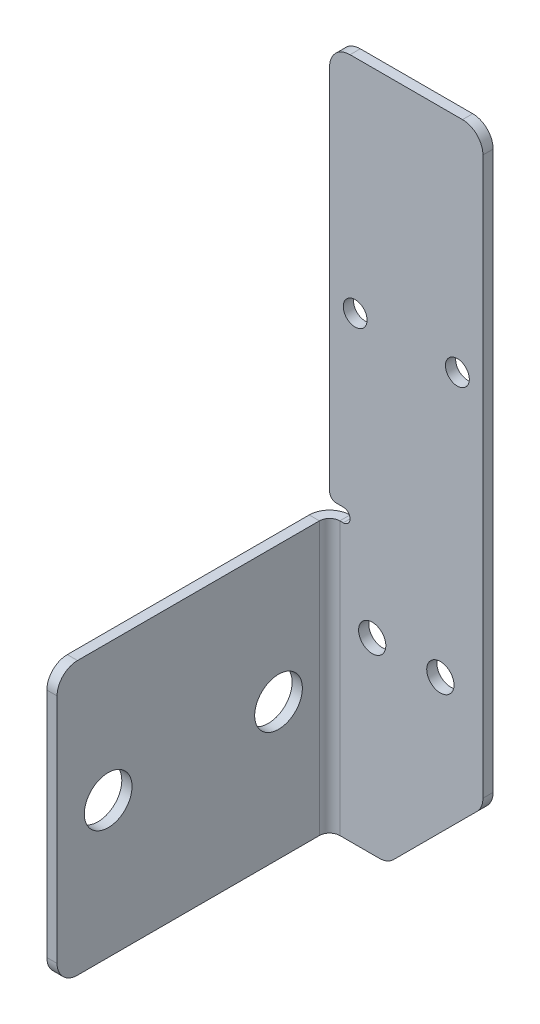
ISO-10303-21;
HEADER;
FILE_DESCRIPTION(('STEP AP214'),'2;1');
FILE_NAME('part.step','',(''),(''),'','','');
FILE_SCHEMA(('AUTOMOTIVE_DESIGN { 1 0 10303 214 1 1 1 1 }'));
ENDSEC;
DATA;
#1=APPLICATION_CONTEXT('core data for automotive mechanical design processes');
#2=APPLICATION_PROTOCOL_DEFINITION('international standard','automotive_design',2000,#1);
#3=PRODUCT_CONTEXT('',#1,'mechanical');
#4=PRODUCT('Part','Part','',(#3));
#5=PRODUCT_RELATED_PRODUCT_CATEGORY('part','',(#4));
#6=PRODUCT_DEFINITION_FORMATION('','',#4);
#7=PRODUCT_DEFINITION_CONTEXT('part definition',#1,'design');
#8=PRODUCT_DEFINITION('design','',#6,#7);
#9=PRODUCT_DEFINITION_SHAPE('','',#8);
#10=(LENGTH_UNIT() NAMED_UNIT(*) SI_UNIT(.MILLI.,.METRE.));
#11=(NAMED_UNIT(*) PLANE_ANGLE_UNIT() SI_UNIT($,.RADIAN.));
#12=(NAMED_UNIT(*) SI_UNIT($,.STERADIAN.) SOLID_ANGLE_UNIT());
#13=UNCERTAINTY_MEASURE_WITH_UNIT(LENGTH_MEASURE(1.E-05),#10,'distance_accuracy_value','');
#14=(GEOMETRIC_REPRESENTATION_CONTEXT(3) GLOBAL_UNCERTAINTY_ASSIGNED_CONTEXT((#13)) GLOBAL_UNIT_ASSIGNED_CONTEXT((#10,
#11,#12)) REPRESENTATION_CONTEXT('',''));
#15=CARTESIAN_POINT('',(0.,0.,0.));
#16=DIRECTION('',(0.,0.,1.));
#17=DIRECTION('',(1.,0.,0.));
#18=AXIS2_PLACEMENT_3D('',#15,#16,#17);
#19=CARTESIAN_POINT('',(10.,0.,1.5));
#20=DIRECTION('',(0.,1.,0.));
#21=DIRECTION('',(1.,0.,0.));
#22=AXIS2_PLACEMENT_3D('',#19,#20,#21);
#23=PLANE('',#22);
#24=DIRECTION('',(0.,0.,1.));
#25=VECTOR('',#24,1.);
#26=CARTESIAN_POINT('',(3.,0.,1.5));
#27=LINE('',#26,#25);
#28=CARTESIAN_POINT('',(3.,0.,0.));
#29=VERTEX_POINT('',#28);
#30=CARTESIAN_POINT('',(3.,0.,1.5));
#31=VERTEX_POINT('',#30);
#32=EDGE_CURVE('E11',#29,#31,#27,.T.);
#33=ORIENTED_EDGE('',*,*,#32,.F.);
#34=DIRECTION('',(-1.,0.,0.));
#35=VECTOR('',#34,1.);
#36=CARTESIAN_POINT('',(0.,0.,0.));
#37=LINE('',#36,#35);
#38=CARTESIAN_POINT('',(8.75735931288071,0.,0.));
#39=VERTEX_POINT('',#38);
#40=EDGE_CURVE('E127',#29,#39,#37,.F.);
#41=ORIENTED_EDGE('',*,*,#40,.T.);
#42=DIRECTION('',(0.,0.,1.));
#43=VECTOR('',#42,1.);
#44=CARTESIAN_POINT('',(8.75735931288071,0.,1.5));
#45=LINE('',#44,#43);
#46=CARTESIAN_POINT('',(8.75735931288071,0.,1.5));
#47=VERTEX_POINT('',#46);
#48=EDGE_CURVE('E49',#39,#47,#45,.T.);
#49=ORIENTED_EDGE('',*,*,#48,.T.);
#50=DIRECTION('',(1.,0.,0.));
#51=VECTOR('',#50,1.);
#52=CARTESIAN_POINT('',(10.,0.,1.5));
#53=LINE('',#52,#51);
#54=EDGE_CURVE('E129',#31,#47,#53,.T.);
#55=ORIENTED_EDGE('',*,*,#54,.F.);
#56=EDGE_LOOP('',(#33,#41,#49,#55));
#57=FACE_BOUND('',#56,.T.);
#58=ADVANCED_FACE('F39',(#57),#23,.F.);
#59=CARTESIAN_POINT('',(8.75735931288071,3.,1.5));
#60=DIRECTION('',(0.,0.,-1.));
#61=DIRECTION('',(-1.,0.,0.));
#62=AXIS2_PLACEMENT_3D('',#59,#60,#61);
#63=CYLINDRICAL_SURFACE('',#62,3.);
#64=ORIENTED_EDGE('',*,*,#48,.F.);
#65=CARTESIAN_POINT('',(8.75735931288071,3.,0.));
#66=DIRECTION('',(0.,0.,-1.));
#67=DIRECTION('',(-1.,0.,0.));
#68=AXIS2_PLACEMENT_3D('',#65,#66,#67);
#69=CIRCLE('',#68,3.);
#70=CARTESIAN_POINT('',(10.8786796564404,0.878679656440359,0.));
#71=VERTEX_POINT('',#70);
#72=EDGE_CURVE('E154',#39,#71,#69,.F.);
#73=ORIENTED_EDGE('',*,*,#72,.T.);
#74=DIRECTION('',(0.,0.,1.));
#75=VECTOR('',#74,1.);
#76=CARTESIAN_POINT('',(10.8786796564404,0.878679656440359,1.5));
#77=LINE('',#76,#75);
#78=CARTESIAN_POINT('',(10.8786796564404,0.878679656440359,1.5));
#79=VERTEX_POINT('',#78);
#80=EDGE_CURVE('E226',#71,#79,#77,.T.);
#81=ORIENTED_EDGE('',*,*,#80,.T.);
#82=CARTESIAN_POINT('',(8.75735931288071,3.,1.5));
#83=DIRECTION('',(0.,0.,-1.));
#84=DIRECTION('',(-1.,0.,0.));
#85=AXIS2_PLACEMENT_3D('',#82,#83,#84);
#86=CIRCLE('',#85,3.);
#87=EDGE_CURVE('E240',#47,#79,#86,.F.);
#88=ORIENTED_EDGE('',*,*,#87,.F.);
#89=EDGE_LOOP('',(#64,#73,#81,#88));
#90=FACE_BOUND('',#89,.T.);
#91=ADVANCED_FACE('F246',(#90),#63,.T.);
#92=CARTESIAN_POINT('',(24.,14.0000000000001,1.5));
#93=DIRECTION('',(-0.707106781186549,0.707106781186546,0.));
#94=DIRECTION('',(0.707106781186546,0.707106781186549,0.));
#95=AXIS2_PLACEMENT_3D('',#92,#93,#94);
#96=PLANE('',#95);
#97=ORIENTED_EDGE('',*,*,#80,.F.);
#98=DIRECTION('',(0.707106781186546,0.707106781186549,0.));
#99=VECTOR('',#98,1.);
#100=CARTESIAN_POINT('',(24.,14.0000000000001,0.));
#101=LINE('',#100,#99);
#102=CARTESIAN_POINT('',(23.1213203435597,13.1213203435597,0.));
#103=VERTEX_POINT('',#102);
#104=EDGE_CURVE('E342',#71,#103,#101,.T.);
#105=ORIENTED_EDGE('',*,*,#104,.T.);
#106=DIRECTION('',(0.,0.,1.));
#107=VECTOR('',#106,1.);
#108=CARTESIAN_POINT('',(23.1213203435597,13.1213203435597,1.5));
#109=LINE('',#108,#107);
#110=CARTESIAN_POINT('',(23.1213203435597,13.1213203435597,1.5));
#111=VERTEX_POINT('',#110);
#112=EDGE_CURVE('E223',#103,#111,#109,.T.);
#113=ORIENTED_EDGE('',*,*,#112,.T.);
#114=DIRECTION('',(0.707106781186546,0.707106781186549,0.));
#115=VECTOR('',#114,1.);
#116=CARTESIAN_POINT('',(24.,14.0000000000001,1.5));
#117=LINE('',#116,#115);
#118=EDGE_CURVE('E247',#79,#111,#117,.T.);
#119=ORIENTED_EDGE('',*,*,#118,.F.);
#120=EDGE_LOOP('',(#97,#105,#113,#119));
#121=FACE_BOUND('',#120,.T.);
#122=ADVANCED_FACE('F345',(#121),#96,.F.);
#123=CARTESIAN_POINT('',(21.,15.2426406871193,1.5));
#124=DIRECTION('',(0.,0.,-1.));
#125=DIRECTION('',(-1.,0.,0.));
#126=AXIS2_PLACEMENT_3D('',#123,#124,#125);
#127=CYLINDRICAL_SURFACE('',#126,3.);
#128=ORIENTED_EDGE('',*,*,#112,.F.);
#129=CARTESIAN_POINT('',(21.,15.2426406871193,0.));
#130=DIRECTION('',(0.,0.,-1.));
#131=DIRECTION('',(-1.,0.,0.));
#132=AXIS2_PLACEMENT_3D('',#129,#130,#131);
#133=CIRCLE('',#132,3.);
#134=CARTESIAN_POINT('',(24.,15.2426406871193,0.));
#135=VERTEX_POINT('',#134);
#136=EDGE_CURVE('E339',#103,#135,#133,.F.);
#137=ORIENTED_EDGE('',*,*,#136,.T.);
#138=DIRECTION('',(0.,0.,1.));
#139=VECTOR('',#138,1.);
#140=CARTESIAN_POINT('',(24.,15.2426406871193,1.5));
#141=LINE('',#140,#139);
#142=CARTESIAN_POINT('',(24.,15.2426406871193,1.5));
#143=VERTEX_POINT('',#142);
#144=EDGE_CURVE('E220',#135,#143,#141,.T.);
#145=ORIENTED_EDGE('',*,*,#144,.T.);
#146=CARTESIAN_POINT('',(21.,15.2426406871193,1.5));
#147=DIRECTION('',(0.,0.,-1.));
#148=DIRECTION('',(-1.,0.,0.));
#149=AXIS2_PLACEMENT_3D('',#146,#147,#148);
#150=CIRCLE('',#149,3.);
#151=EDGE_CURVE('E249',#111,#143,#150,.F.);
#152=ORIENTED_EDGE('',*,*,#151,.F.);
#153=EDGE_LOOP('',(#128,#137,#145,#152));
#154=FACE_BOUND('',#153,.T.);
#155=ADVANCED_FACE('F351',(#154),#127,.T.);
#156=CARTESIAN_POINT('',(24.,100.,1.5));
#157=DIRECTION('',(-1.,0.,0.));
#158=DIRECTION('',(0.,1.,0.));
#159=AXIS2_PLACEMENT_3D('',#156,#157,#158);
#160=PLANE('',#159);
#161=ORIENTED_EDGE('',*,*,#144,.F.);
#162=DIRECTION('',(0.,1.,0.));
#163=VECTOR('',#162,1.);
#164=CARTESIAN_POINT('',(24.,0.,0.));
#165=LINE('',#164,#163);
#166=CARTESIAN_POINT('',(24.,97.,0.));
#167=VERTEX_POINT('',#166);
#168=EDGE_CURVE('E336',#135,#167,#165,.T.);
#169=ORIENTED_EDGE('',*,*,#168,.T.);
#170=DIRECTION('',(0.,0.,1.));
#171=VECTOR('',#170,1.);
#172=CARTESIAN_POINT('',(24.,97.,1.5));
#173=LINE('',#172,#171);
#174=CARTESIAN_POINT('',(24.,97.,1.5));
#175=VERTEX_POINT('',#174);
#176=EDGE_CURVE('E217',#167,#175,#173,.T.);
#177=ORIENTED_EDGE('',*,*,#176,.T.);
#178=DIRECTION('',(0.,1.,0.));
#179=VECTOR('',#178,1.);
#180=CARTESIAN_POINT('',(24.,100.,1.5));
#181=LINE('',#180,#179);
#182=EDGE_CURVE('E255',#143,#175,#181,.T.);
#183=ORIENTED_EDGE('',*,*,#182,.F.);
#184=EDGE_LOOP('',(#161,#169,#177,#183));
#185=FACE_BOUND('',#184,.T.);
#186=ADVANCED_FACE('F360',(#185),#160,.F.);
#187=CARTESIAN_POINT('',(21.,97.,1.5));
#188=DIRECTION('',(0.,0.,-1.));
#189=DIRECTION('',(-1.,0.,0.));
#190=AXIS2_PLACEMENT_3D('',#187,#188,#189);
#191=CYLINDRICAL_SURFACE('',#190,3.);
#192=ORIENTED_EDGE('',*,*,#176,.F.);
#193=CARTESIAN_POINT('',(21.,97.,0.));
#194=DIRECTION('',(0.,0.,-1.));
#195=DIRECTION('',(-1.,0.,0.));
#196=AXIS2_PLACEMENT_3D('',#193,#194,#195);
#197=CIRCLE('',#196,3.);
#198=CARTESIAN_POINT('',(21.,100.,0.));
#199=VERTEX_POINT('',#198);
#200=EDGE_CURVE('E296',#167,#199,#197,.F.);
#201=ORIENTED_EDGE('',*,*,#200,.T.);
#202=DIRECTION('',(0.,0.,1.));
#203=VECTOR('',#202,1.);
#204=CARTESIAN_POINT('',(21.,100.,1.5));
#205=LINE('',#204,#203);
#206=CARTESIAN_POINT('',(21.,100.,1.5));
#207=VERTEX_POINT('',#206);
#208=EDGE_CURVE('E214',#199,#207,#205,.T.);
#209=ORIENTED_EDGE('',*,*,#208,.T.);
#210=CARTESIAN_POINT('',(21.,97.,1.5));
#211=DIRECTION('',(0.,0.,-1.));
#212=DIRECTION('',(-1.,0.,0.));
#213=AXIS2_PLACEMENT_3D('',#210,#211,#212);
#214=CIRCLE('',#213,3.);
#215=EDGE_CURVE('E258',#175,#207,#214,.F.);
#216=ORIENTED_EDGE('',*,*,#215,.F.);
#217=EDGE_LOOP('',(#192,#201,#209,#216));
#218=FACE_BOUND('',#217,.T.);
#219=ADVANCED_FACE('F364',(#218),#191,.T.);
#220=CARTESIAN_POINT('',(0.,100.,1.5));
#221=DIRECTION('',(0.,-1.,0.));
#222=DIRECTION('',(-1.,0.,0.));
#223=AXIS2_PLACEMENT_3D('',#220,#221,#222);
#224=PLANE('',#223);
#225=ORIENTED_EDGE('',*,*,#208,.F.);
#226=DIRECTION('',(-1.,0.,0.));
#227=VECTOR('',#226,1.);
#228=CARTESIAN_POINT('',(0.,100.,0.));
#229=LINE('',#228,#227);
#230=CARTESIAN_POINT('',(4.5,100.,0.));
#231=VERTEX_POINT('',#230);
#232=EDGE_CURVE('E175',#199,#231,#229,.T.);
#233=ORIENTED_EDGE('',*,*,#232,.T.);
#234=DIRECTION('',(0.,0.,1.));
#235=VECTOR('',#234,1.);
#236=CARTESIAN_POINT('',(4.5,100.,1.5));
#237=LINE('',#236,#235);
#238=CARTESIAN_POINT('',(4.5,100.,1.5));
#239=VERTEX_POINT('',#238);
#240=EDGE_CURVE('E211',#231,#239,#237,.T.);
#241=ORIENTED_EDGE('',*,*,#240,.T.);
#242=DIRECTION('',(-1.,0.,0.));
#243=VECTOR('',#242,1.);
#244=CARTESIAN_POINT('',(0.,100.,1.5));
#245=LINE('',#244,#243);
#246=EDGE_CURVE('E373',#207,#239,#245,.T.);
#247=ORIENTED_EDGE('',*,*,#246,.F.);
#248=EDGE_LOOP('',(#225,#233,#241,#247));
#249=FACE_BOUND('',#248,.T.);
#250=ADVANCED_FACE('F369',(#249),#224,.F.);
#251=CARTESIAN_POINT('',(4.5,97.,1.5));
#252=DIRECTION('',(0.,0.,-1.));
#253=DIRECTION('',(-1.,0.,0.));
#254=AXIS2_PLACEMENT_3D('',#251,#252,#253);
#255=CYLINDRICAL_SURFACE('',#254,3.);
#256=ORIENTED_EDGE('',*,*,#240,.F.);
#257=CARTESIAN_POINT('',(4.5,97.,0.));
#258=DIRECTION('',(0.,0.,-1.));
#259=DIRECTION('',(-1.,0.,0.));
#260=AXIS2_PLACEMENT_3D('',#257,#258,#259);
#261=CIRCLE('',#260,3.);
#262=CARTESIAN_POINT('',(1.5,97.,0.));
#263=VERTEX_POINT('',#262);
#264=EDGE_CURVE('E329',#231,#263,#261,.F.);
#265=ORIENTED_EDGE('',*,*,#264,.T.);
#266=DIRECTION('',(0.,0.,1.));
#267=VECTOR('',#266,1.);
#268=CARTESIAN_POINT('',(1.5,97.,1.5));
#269=LINE('',#268,#267);
#270=CARTESIAN_POINT('',(1.5,97.,1.5));
#271=VERTEX_POINT('',#270);
#272=EDGE_CURVE('E208',#263,#271,#269,.T.);
#273=ORIENTED_EDGE('',*,*,#272,.T.);
#274=CARTESIAN_POINT('',(4.5,97.,1.5));
#275=DIRECTION('',(0.,0.,-1.));
#276=DIRECTION('',(-1.,0.,0.));
#277=AXIS2_PLACEMENT_3D('',#274,#275,#276);
#278=CIRCLE('',#277,3.);
#279=EDGE_CURVE('E380',#239,#271,#278,.F.);
#280=ORIENTED_EDGE('',*,*,#279,.F.);
#281=EDGE_LOOP('',(#256,#265,#273,#280));
#282=FACE_BOUND('',#281,.T.);
#283=ADVANCED_FACE('F386',(#282),#255,.T.);
#284=CARTESIAN_POINT('',(1.5,0.,1.5));
#285=DIRECTION('',(1.,0.,0.));
#286=DIRECTION('',(0.,-1.,0.));
#287=AXIS2_PLACEMENT_3D('',#284,#285,#286);
#288=PLANE('',#287);
#289=ORIENTED_EDGE('',*,*,#272,.F.);
#290=DIRECTION('',(0.,1.,0.));
#291=VECTOR('',#290,1.);
#292=CARTESIAN_POINT('',(1.5,0.,0.));
#293=LINE('',#292,#291);
#294=CARTESIAN_POINT('',(1.5,43.,0.));
#295=VERTEX_POINT('',#294);
#296=EDGE_CURVE('E326',#263,#295,#293,.F.);
#297=ORIENTED_EDGE('',*,*,#296,.T.);
#298=DIRECTION('',(0.,0.,1.));
#299=VECTOR('',#298,1.);
#300=CARTESIAN_POINT('',(1.5,43.,1.5));
#301=LINE('',#300,#299);
#302=CARTESIAN_POINT('',(1.5,43.,1.5));
#303=VERTEX_POINT('',#302);
#304=EDGE_CURVE('E205',#295,#303,#301,.T.);
#305=ORIENTED_EDGE('',*,*,#304,.T.);
#306=DIRECTION('',(0.,-1.,0.));
#307=VECTOR('',#306,1.);
#308=CARTESIAN_POINT('',(1.5,0.,1.5));
#309=LINE('',#308,#307);
#310=EDGE_CURVE('E387',#271,#303,#309,.T.);
#311=ORIENTED_EDGE('',*,*,#310,.F.);
#312=EDGE_LOOP('',(#289,#297,#305,#311));
#313=FACE_BOUND('',#312,.T.);
#314=ADVANCED_FACE('F442',(#313),#288,.F.);
#315=CARTESIAN_POINT('',(2.5,43.,1.5));
#316=DIRECTION('',(0.,0.,-1.));
#317=DIRECTION('',(-1.,0.,0.));
#318=AXIS2_PLACEMENT_3D('',#315,#316,#317);
#319=CYLINDRICAL_SURFACE('',#318,1.);
#320=ORIENTED_EDGE('',*,*,#304,.F.);
#321=CARTESIAN_POINT('',(2.5,43.,0.));
#322=DIRECTION('',(0.,0.,-1.));
#323=DIRECTION('',(-1.,0.,0.));
#324=AXIS2_PLACEMENT_3D('',#321,#322,#323);
#325=CIRCLE('',#324,1.);
#326=CARTESIAN_POINT('',(2.5,42.,0.));
#327=VERTEX_POINT('',#326);
#328=EDGE_CURVE('E323',#295,#327,#325,.F.);
#329=ORIENTED_EDGE('',*,*,#328,.T.);
#330=DIRECTION('',(0.,0.,1.));
#331=VECTOR('',#330,1.);
#332=CARTESIAN_POINT('',(2.5,42.,1.5));
#333=LINE('',#332,#331);
#334=CARTESIAN_POINT('',(2.5,42.,1.5));
#335=VERTEX_POINT('',#334);
#336=EDGE_CURVE('E202',#327,#335,#333,.T.);
#337=ORIENTED_EDGE('',*,*,#336,.T.);
#338=CARTESIAN_POINT('',(2.5,43.,1.5));
#339=DIRECTION('',(0.,0.,-1.));
#340=DIRECTION('',(-1.,0.,0.));
#341=AXIS2_PLACEMENT_3D('',#338,#339,#340);
#342=CIRCLE('',#341,1.);
#343=EDGE_CURVE('E389',#303,#335,#342,.F.);
#344=ORIENTED_EDGE('',*,*,#343,.F.);
#345=EDGE_LOOP('',(#320,#329,#337,#344));
#346=FACE_BOUND('',#345,.T.);
#347=ADVANCED_FACE('F447',(#346),#319,.T.);
#348=CARTESIAN_POINT('',(1.5,42.,1.5));
#349=DIRECTION('',(0.,-1.,0.));
#350=DIRECTION('',(-1.,0.,0.));
#351=AXIS2_PLACEMENT_3D('',#348,#349,#350);
#352=PLANE('',#351);
#353=ORIENTED_EDGE('',*,*,#336,.F.);
#354=DIRECTION('',(-1.,0.,0.));
#355=VECTOR('',#354,1.);
#356=CARTESIAN_POINT('',(0.,42.,0.));
#357=LINE('',#356,#355);
#358=CARTESIAN_POINT('',(3.5,42.,0.));
#359=VERTEX_POINT('',#358);
#360=EDGE_CURVE('E320',#359,#327,#357,.T.);
#361=ORIENTED_EDGE('',*,*,#360,.F.);
#362=DIRECTION('',(0.,0.,1.));
#363=VECTOR('',#362,1.);
#364=CARTESIAN_POINT('',(3.5,42.,1.5));
#365=LINE('',#364,#363);
#366=CARTESIAN_POINT('',(3.5,42.,1.5));
#367=VERTEX_POINT('',#366);
#368=EDGE_CURVE('E199',#359,#367,#365,.T.);
#369=ORIENTED_EDGE('',*,*,#368,.T.);
#370=DIRECTION('',(-1.,0.,0.));
#371=VECTOR('',#370,1.);
#372=CARTESIAN_POINT('',(1.5,42.,1.5));
#373=LINE('',#372,#371);
#374=EDGE_CURVE('E395',#367,#335,#373,.T.);
#375=ORIENTED_EDGE('',*,*,#374,.T.);
#376=EDGE_LOOP('',(#353,#361,#369,#375));
#377=FACE_BOUND('',#376,.T.);
#378=ADVANCED_FACE('F450',(#377),#352,.T.);
#379=CARTESIAN_POINT('',(3.5,41.,1.5));
#380=DIRECTION('',(0.,0.,-1.));
#381=DIRECTION('',(-1.,0.,0.));
#382=AXIS2_PLACEMENT_3D('',#379,#380,#381);
#383=CYLINDRICAL_SURFACE('',#382,1.);
#384=ORIENTED_EDGE('',*,*,#368,.F.);
#385=CARTESIAN_POINT('',(3.5,41.,0.));
#386=DIRECTION('',(0.,0.,-1.));
#387=DIRECTION('',(-1.,0.,0.));
#388=AXIS2_PLACEMENT_3D('',#385,#386,#387);
#389=CIRCLE('',#388,1.);
#390=CARTESIAN_POINT('',(4.5,41.,0.));
#391=VERTEX_POINT('',#390);
#392=EDGE_CURVE('E317',#359,#391,#389,.T.);
#393=ORIENTED_EDGE('',*,*,#392,.T.);
#394=DIRECTION('',(0.,0.,1.));
#395=VECTOR('',#394,1.);
#396=CARTESIAN_POINT('',(4.5,41.,1.5));
#397=LINE('',#396,#395);
#398=CARTESIAN_POINT('',(4.5,41.,1.5));
#399=VERTEX_POINT('',#398);
#400=EDGE_CURVE('E196',#391,#399,#397,.T.);
#401=ORIENTED_EDGE('',*,*,#400,.T.);
#402=CARTESIAN_POINT('',(3.5,41.,1.5));
#403=DIRECTION('',(0.,0.,-1.));
#404=DIRECTION('',(-1.,0.,0.));
#405=AXIS2_PLACEMENT_3D('',#402,#403,#404);
#406=CIRCLE('',#405,1.);
#407=EDGE_CURVE('E398',#367,#399,#406,.T.);
#408=ORIENTED_EDGE('',*,*,#407,.F.);
#409=EDGE_LOOP('',(#384,#393,#401,#408));
#410=FACE_BOUND('',#409,.T.);
#411=ADVANCED_FACE('F454',(#410),#383,.F.);
#412=CARTESIAN_POINT('',(3.5,41.,1.5));
#413=DIRECTION('',(0.,0.,-1.));
#414=DIRECTION('',(-1.,0.,0.));
#415=AXIS2_PLACEMENT_3D('',#412,#413,#414);
#416=CYLINDRICAL_SURFACE('',#415,1.);
#417=ORIENTED_EDGE('',*,*,#400,.F.);
#418=CARTESIAN_POINT('',(3.5,41.,0.));
#419=DIRECTION('',(0.,0.,-1.));
#420=DIRECTION('',(-1.,0.,0.));
#421=AXIS2_PLACEMENT_3D('',#418,#419,#420);
#422=CIRCLE('',#421,1.);
#423=CARTESIAN_POINT('',(3.5,40.,0.));
#424=VERTEX_POINT('',#423);
#425=EDGE_CURVE('E314',#391,#424,#422,.T.);
#426=ORIENTED_EDGE('',*,*,#425,.T.);
#427=DIRECTION('',(0.,0.,1.));
#428=VECTOR('',#427,1.);
#429=CARTESIAN_POINT('',(3.5,40.,1.5));
#430=LINE('',#429,#428);
#431=CARTESIAN_POINT('',(3.5,40.,1.5));
#432=VERTEX_POINT('',#431);
#433=EDGE_CURVE('E193',#424,#432,#430,.T.);
#434=ORIENTED_EDGE('',*,*,#433,.T.);
#435=CARTESIAN_POINT('',(3.5,41.,1.5));
#436=DIRECTION('',(0.,0.,-1.));
#437=DIRECTION('',(-1.,0.,0.));
#438=AXIS2_PLACEMENT_3D('',#435,#436,#437);
#439=CIRCLE('',#438,1.);
#440=EDGE_CURVE('E401',#399,#432,#439,.T.);
#441=ORIENTED_EDGE('',*,*,#440,.F.);
#442=EDGE_LOOP('',(#417,#426,#434,#441));
#443=FACE_BOUND('',#442,.T.);
#444=ADVANCED_FACE('F457',(#443),#416,.F.);
#445=CARTESIAN_POINT('',(1.5,40.,1.5));
#446=DIRECTION('',(0.,1.,0.));
#447=DIRECTION('',(1.,0.,0.));
#448=AXIS2_PLACEMENT_3D('',#445,#446,#447);
#449=PLANE('',#448);
#450=ORIENTED_EDGE('',*,*,#433,.F.);
#451=DIRECTION('',(-1.,0.,0.));
#452=VECTOR('',#451,1.);
#453=CARTESIAN_POINT('',(0.,40.,0.));
#454=LINE('',#453,#452);
#455=CARTESIAN_POINT('',(3.,40.,0.));
#456=VERTEX_POINT('',#455);
#457=EDGE_CURVE('E155',#456,#424,#454,.F.);
#458=ORIENTED_EDGE('',*,*,#457,.F.);
#459=DIRECTION('',(0.,0.,1.));
#460=VECTOR('',#459,1.);
#461=CARTESIAN_POINT('',(3.,40.,1.5));
#462=LINE('',#461,#460);
#463=CARTESIAN_POINT('',(3.,40.,1.5));
#464=VERTEX_POINT('',#463);
#465=EDGE_CURVE('E190',#456,#464,#462,.T.);
#466=ORIENTED_EDGE('',*,*,#465,.T.);
#467=DIRECTION('',(1.,0.,0.));
#468=VECTOR('',#467,1.);
#469=CARTESIAN_POINT('',(1.5,40.,1.5));
#470=LINE('',#469,#468);
#471=EDGE_CURVE('E244',#464,#432,#470,.T.);
#472=ORIENTED_EDGE('',*,*,#471,.T.);
#473=EDGE_LOOP('',(#450,#458,#466,#472));
#474=FACE_BOUND('',#473,.T.);
#475=ADVANCED_FACE('F405',(#474),#449,.T.);
#476=CARTESIAN_POINT('',(3.,40.,3.));
#477=DIRECTION('',(0.,1.,0.));
#478=DIRECTION('',(0.,0.,1.));
#479=AXIS2_PLACEMENT_3D('',#476,#477,#478);
#480=PLANE('',#479);
#481=ORIENTED_EDGE('',*,*,#465,.F.);
#482=CARTESIAN_POINT('',(3.,40.,3.));
#483=DIRECTION('',(0.,-1.,0.));
#484=DIRECTION('',(0.,0.,-1.));
#485=AXIS2_PLACEMENT_3D('',#482,#483,#484);
#486=CIRCLE('',#485,3.);
#487=CARTESIAN_POINT('',(0.,40.,3.));
#488=VERTEX_POINT('',#487);
#489=EDGE_CURVE('E143',#456,#488,#486,.F.);
#490=ORIENTED_EDGE('',*,*,#489,.T.);
#491=DIRECTION('',(1.,0.,0.));
#492=VECTOR('',#491,1.);
#493=CARTESIAN_POINT('',(1.5,40.,3.));
#494=LINE('',#493,#492);
#495=CARTESIAN_POINT('',(1.5,40.,3.));
#496=VERTEX_POINT('',#495);
#497=EDGE_CURVE('E188',#488,#496,#494,.T.);
#498=ORIENTED_EDGE('',*,*,#497,.T.);
#499=CARTESIAN_POINT('',(3.,40.,3.));
#500=DIRECTION('',(0.,-1.,0.));
#501=DIRECTION('',(0.,0.,-1.));
#502=AXIS2_PLACEMENT_3D('',#499,#500,#501);
#503=CIRCLE('',#502,1.5);
#504=EDGE_CURVE('E287',#464,#496,#503,.F.);
#505=ORIENTED_EDGE('',*,*,#504,.F.);
#506=EDGE_LOOP('',(#481,#490,#498,#505));
#507=FACE_BOUND('',#506,.T.);
#508=ADVANCED_FACE('F414',(#507),#480,.T.);
#509=CARTESIAN_POINT('',(1.5,40.,1.5));
#510=DIRECTION('',(0.,-1.,0.));
#511=DIRECTION('',(0.,0.,-1.));
#512=AXIS2_PLACEMENT_3D('',#509,#510,#511);
#513=PLANE('',#512);
#514=ORIENTED_EDGE('',*,*,#497,.F.);
#515=DIRECTION('',(0.,0.,-1.));
#516=VECTOR('',#515,1.);
#517=CARTESIAN_POINT('',(0.,40.,0.));
#518=LINE('',#517,#516);
#519=CARTESIAN_POINT('',(0.,40.,38.5));
#520=VERTEX_POINT('',#519);
#521=EDGE_CURVE('E299',#520,#488,#518,.T.);
#522=ORIENTED_EDGE('',*,*,#521,.F.);
#523=DIRECTION('',(1.,0.,0.));
#524=VECTOR('',#523,1.);
#525=CARTESIAN_POINT('',(1.5,40.,38.5));
#526=LINE('',#525,#524);
#527=CARTESIAN_POINT('',(1.5,40.,38.5));
#528=VERTEX_POINT('',#527);
#529=EDGE_CURVE('E185',#520,#528,#526,.T.);
#530=ORIENTED_EDGE('',*,*,#529,.T.);
#531=DIRECTION('',(0.,0.,-1.));
#532=VECTOR('',#531,1.);
#533=CARTESIAN_POINT('',(1.5,40.,1.5));
#534=LINE('',#533,#532);
#535=EDGE_CURVE('E267',#528,#496,#534,.T.);
#536=ORIENTED_EDGE('',*,*,#535,.T.);
#537=EDGE_LOOP('',(#514,#522,#530,#536));
#538=FACE_BOUND('',#537,.T.);
#539=ADVANCED_FACE('F534',(#538),#513,.F.);
#540=CARTESIAN_POINT('',(1.5,37.,38.5));
#541=DIRECTION('',(1.,0.,0.));
#542=DIRECTION('',(0.,0.,-1.));
#543=AXIS2_PLACEMENT_3D('',#540,#541,#542);
#544=CYLINDRICAL_SURFACE('',#543,3.);
#545=ORIENTED_EDGE('',*,*,#529,.F.);
#546=CARTESIAN_POINT('',(0.,37.,38.5));
#547=DIRECTION('',(1.,0.,0.));
#548=DIRECTION('',(0.,0.,-1.));
#549=AXIS2_PLACEMENT_3D('',#546,#547,#548);
#550=CIRCLE('',#549,3.);
#551=CARTESIAN_POINT('',(0.,37.,41.5));
#552=VERTEX_POINT('',#551);
#553=EDGE_CURVE('E308',#520,#552,#550,.T.);
#554=ORIENTED_EDGE('',*,*,#553,.T.);
#555=DIRECTION('',(1.,0.,0.));
#556=VECTOR('',#555,1.);
#557=CARTESIAN_POINT('',(1.5,37.,41.5));
#558=LINE('',#557,#556);
#559=CARTESIAN_POINT('',(1.5,37.,41.5));
#560=VERTEX_POINT('',#559);
#561=EDGE_CURVE('E182',#552,#560,#558,.T.);
#562=ORIENTED_EDGE('',*,*,#561,.T.);
#563=CARTESIAN_POINT('',(1.5,37.,38.5));
#564=DIRECTION('',(1.,0.,0.));
#565=DIRECTION('',(0.,0.,-1.));
#566=AXIS2_PLACEMENT_3D('',#563,#564,#565);
#567=CIRCLE('',#566,3.);
#568=EDGE_CURVE('E270',#528,#560,#567,.T.);
#569=ORIENTED_EDGE('',*,*,#568,.F.);
#570=EDGE_LOOP('',(#545,#554,#562,#569));
#571=FACE_BOUND('',#570,.T.);
#572=ADVANCED_FACE('F530',(#571),#544,.T.);
#573=CARTESIAN_POINT('',(1.5,0.,41.5));
#574=DIRECTION('',(0.,0.,-1.));
#575=DIRECTION('',(0.,1.,0.));
#576=AXIS2_PLACEMENT_3D('',#573,#574,#575);
#577=PLANE('',#576);
#578=ORIENTED_EDGE('',*,*,#561,.F.);
#579=DIRECTION('',(0.,1.,0.));
#580=VECTOR('',#579,1.);
#581=CARTESIAN_POINT('',(0.,0.,41.5));
#582=LINE('',#581,#580);
#583=CARTESIAN_POINT('',(0.,3.,41.5));
#584=VERTEX_POINT('',#583);
#585=EDGE_CURVE('E305',#584,#552,#582,.T.);
#586=ORIENTED_EDGE('',*,*,#585,.F.);
#587=DIRECTION('',(1.,0.,0.));
#588=VECTOR('',#587,1.);
#589=CARTESIAN_POINT('',(1.5,3.,41.5));
#590=LINE('',#589,#588);
#591=CARTESIAN_POINT('',(1.5,3.,41.5));
#592=VERTEX_POINT('',#591);
#593=EDGE_CURVE('E179',#584,#592,#590,.T.);
#594=ORIENTED_EDGE('',*,*,#593,.T.);
#595=DIRECTION('',(0.,1.,0.));
#596=VECTOR('',#595,1.);
#597=CARTESIAN_POINT('',(1.5,0.,41.5));
#598=LINE('',#597,#596);
#599=EDGE_CURVE('E273',#592,#560,#598,.T.);
#600=ORIENTED_EDGE('',*,*,#599,.T.);
#601=EDGE_LOOP('',(#578,#586,#594,#600));
#602=FACE_BOUND('',#601,.T.);
#603=ADVANCED_FACE('F527',(#602),#577,.F.);
#604=CARTESIAN_POINT('',(1.5,3.,38.5));
#605=DIRECTION('',(1.,0.,0.));
#606=DIRECTION('',(0.,0.,-1.));
#607=AXIS2_PLACEMENT_3D('',#604,#605,#606);
#608=CYLINDRICAL_SURFACE('',#607,3.);
#609=ORIENTED_EDGE('',*,*,#593,.F.);
#610=CARTESIAN_POINT('',(0.,3.,38.5));
#611=DIRECTION('',(1.,0.,0.));
#612=DIRECTION('',(0.,0.,-1.));
#613=AXIS2_PLACEMENT_3D('',#610,#611,#612);
#614=CIRCLE('',#613,3.);
#615=CARTESIAN_POINT('',(0.,0.,38.5));
#616=VERTEX_POINT('',#615);
#617=EDGE_CURVE('E302',#584,#616,#614,.T.);
#618=ORIENTED_EDGE('',*,*,#617,.T.);
#619=DIRECTION('',(1.,0.,0.));
#620=VECTOR('',#619,1.);
#621=CARTESIAN_POINT('',(1.5,0.,38.5));
#622=LINE('',#621,#620);
#623=CARTESIAN_POINT('',(1.5,0.,38.5));
#624=VERTEX_POINT('',#623);
#625=EDGE_CURVE('E176',#616,#624,#622,.T.);
#626=ORIENTED_EDGE('',*,*,#625,.T.);
#627=CARTESIAN_POINT('',(1.5,3.,38.5));
#628=DIRECTION('',(1.,0.,0.));
#629=DIRECTION('',(0.,0.,-1.));
#630=AXIS2_PLACEMENT_3D('',#627,#628,#629);
#631=CIRCLE('',#630,3.);
#632=EDGE_CURVE('E276',#592,#624,#631,.T.);
#633=ORIENTED_EDGE('',*,*,#632,.F.);
#634=EDGE_LOOP('',(#609,#618,#626,#633));
#635=FACE_BOUND('',#634,.T.);
#636=ADVANCED_FACE('F524',(#635),#608,.T.);
#637=CARTESIAN_POINT('',(1.5,0.,1.5));
#638=DIRECTION('',(0.,1.,0.));
#639=DIRECTION('',(0.,0.,1.));
#640=AXIS2_PLACEMENT_3D('',#637,#638,#639);
#641=PLANE('',#640);
#642=ORIENTED_EDGE('',*,*,#625,.F.);
#643=DIRECTION('',(0.,0.,-1.));
#644=VECTOR('',#643,1.);
#645=CARTESIAN_POINT('',(0.,0.,0.));
#646=LINE('',#645,#644);
#647=CARTESIAN_POINT('',(0.,0.,3.));
#648=VERTEX_POINT('',#647);
#649=EDGE_CURVE('E148',#648,#616,#646,.F.);
#650=ORIENTED_EDGE('',*,*,#649,.F.);
#651=DIRECTION('',(1.,0.,0.));
#652=VECTOR('',#651,1.);
#653=CARTESIAN_POINT('',(1.5,0.,3.));
#654=LINE('',#653,#652);
#655=CARTESIAN_POINT('',(1.5,0.,3.));
#656=VERTEX_POINT('',#655);
#657=EDGE_CURVE('E43',#648,#656,#654,.T.);
#658=ORIENTED_EDGE('',*,*,#657,.T.);
#659=DIRECTION('',(0.,0.,1.));
#660=VECTOR('',#659,1.);
#661=CARTESIAN_POINT('',(1.5,0.,1.5));
#662=LINE('',#661,#660);
#663=EDGE_CURVE('E279',#656,#624,#662,.T.);
#664=ORIENTED_EDGE('',*,*,#663,.T.);
#665=EDGE_LOOP('',(#642,#650,#658,#664));
#666=FACE_BOUND('',#665,.T.);
#667=ADVANCED_FACE('F424',(#666),#641,.F.);
#668=CARTESIAN_POINT('',(20.25,67.5,1.5));
#669=DIRECTION('',(0.,0.,-1.));
#670=DIRECTION('',(-1.,0.,0.));
#671=AXIS2_PLACEMENT_3D('',#668,#669,#670);
#672=CYLINDRICAL_SURFACE('',#671,1.75);
#673=CARTESIAN_POINT('',(20.25,67.5,1.5));
#674=DIRECTION('',(0.,0.,-1.));
#675=DIRECTION('',(-1.,0.,0.));
#676=AXIS2_PLACEMENT_3D('',#673,#674,#675);
#677=CIRCLE('',#676,1.75);
#678=CARTESIAN_POINT('',(18.5,67.5,1.5));
#679=VERTEX_POINT('',#678);
#680=EDGE_CURVE('E290',#679,#679,#677,.T.);
#681=ORIENTED_EDGE('',*,*,#680,.F.);
#682=EDGE_LOOP('',(#681));
#683=FACE_BOUND('',#682,.T.);
#684=CARTESIAN_POINT('',(20.25,67.5,0.));
#685=DIRECTION('',(0.,0.,-1.));
#686=DIRECTION('',(-1.,0.,0.));
#687=AXIS2_PLACEMENT_3D('',#684,#685,#686);
#688=CIRCLE('',#687,1.75);
#689=CARTESIAN_POINT('',(18.5,67.5,0.));
#690=VERTEX_POINT('',#689);
#691=EDGE_CURVE('E160',#690,#690,#688,.T.);
#692=ORIENTED_EDGE('',*,*,#691,.T.);
#693=EDGE_LOOP('',(#692));
#694=FACE_BOUND('',#693,.T.);
#695=ADVANCED_FACE('F477',(#683,#694),#672,.F.);
#696=CARTESIAN_POINT('',(7.75,27.5,1.5));
#697=DIRECTION('',(0.,0.,-1.));
#698=DIRECTION('',(-1.,0.,0.));
#699=AXIS2_PLACEMENT_3D('',#696,#697,#698);
#700=CYLINDRICAL_SURFACE('',#699,2.);
#701=CARTESIAN_POINT('',(7.75,27.5,1.5));
#702=DIRECTION('',(0.,0.,-1.));
#703=DIRECTION('',(-1.,0.,0.));
#704=AXIS2_PLACEMENT_3D('',#701,#702,#703);
#705=CIRCLE('',#704,2.);
#706=CARTESIAN_POINT('',(5.75,27.5,1.5));
#707=VERTEX_POINT('',#706);
#708=EDGE_CURVE('E901',#707,#707,#705,.T.);
#709=ORIENTED_EDGE('',*,*,#708,.F.);
#710=EDGE_LOOP('',(#709));
#711=FACE_BOUND('',#710,.T.);
#712=CARTESIAN_POINT('',(7.75,27.5,0.));
#713=DIRECTION('',(0.,0.,-1.));
#714=DIRECTION('',(-1.,0.,0.));
#715=AXIS2_PLACEMENT_3D('',#712,#713,#714);
#716=CIRCLE('',#715,2.);
#717=CARTESIAN_POINT('',(5.75,27.5,0.));
#718=VERTEX_POINT('',#717);
#719=EDGE_CURVE('E166',#718,#718,#716,.T.);
#720=ORIENTED_EDGE('',*,*,#719,.T.);
#721=EDGE_LOOP('',(#720));
#722=FACE_BOUND('',#721,.T.);
#723=ADVANCED_FACE('F480',(#711,#722),#700,.F.);
#724=CARTESIAN_POINT('',(17.75,27.5,1.5));
#725=DIRECTION('',(0.,0.,-1.));
#726=DIRECTION('',(-1.,0.,0.));
#727=AXIS2_PLACEMENT_3D('',#724,#725,#726);
#728=CYLINDRICAL_SURFACE('',#727,2.);
#729=CARTESIAN_POINT('',(17.75,27.5,1.5));
#730=DIRECTION('',(0.,0.,-1.));
#731=DIRECTION('',(-1.,0.,0.));
#732=AXIS2_PLACEMENT_3D('',#729,#730,#731);
#733=CIRCLE('',#732,2.);
#734=CARTESIAN_POINT('',(15.75,27.5,1.5));
#735=VERTEX_POINT('',#734);
#736=EDGE_CURVE('E495',#735,#735,#733,.T.);
#737=ORIENTED_EDGE('',*,*,#736,.F.);
#738=EDGE_LOOP('',(#737));
#739=FACE_BOUND('',#738,.T.);
#740=CARTESIAN_POINT('',(17.75,27.5,0.));
#741=DIRECTION('',(0.,0.,-1.));
#742=DIRECTION('',(-1.,0.,0.));
#743=AXIS2_PLACEMENT_3D('',#740,#741,#742);
#744=CIRCLE('',#743,2.);
#745=CARTESIAN_POINT('',(15.75,27.5,0.));
#746=VERTEX_POINT('',#745);
#747=EDGE_CURVE('E169',#746,#746,#744,.T.);
#748=ORIENTED_EDGE('',*,*,#747,.T.);
#749=EDGE_LOOP('',(#748));
#750=FACE_BOUND('',#749,.T.);
#751=ADVANCED_FACE('F483',(#739,#750),#728,.F.);
#752=CARTESIAN_POINT('',(5.25,67.5,1.5));
#753=DIRECTION('',(0.,0.,-1.));
#754=DIRECTION('',(-1.,0.,0.));
#755=AXIS2_PLACEMENT_3D('',#752,#753,#754);
#756=CYLINDRICAL_SURFACE('',#755,1.75);
#757=CARTESIAN_POINT('',(5.25,67.5,1.5));
#758=DIRECTION('',(0.,0.,-1.));
#759=DIRECTION('',(-1.,0.,0.));
#760=AXIS2_PLACEMENT_3D('',#757,#758,#759);
#761=CIRCLE('',#760,1.75);
#762=CARTESIAN_POINT('',(3.5,67.5,1.5));
#763=VERTEX_POINT('',#762);
#764=EDGE_CURVE('E383',#763,#763,#761,.T.);
#765=ORIENTED_EDGE('',*,*,#764,.F.);
#766=EDGE_LOOP('',(#765));
#767=FACE_BOUND('',#766,.T.);
#768=CARTESIAN_POINT('',(5.25,67.5,0.));
#769=DIRECTION('',(0.,0.,-1.));
#770=DIRECTION('',(-1.,0.,0.));
#771=AXIS2_PLACEMENT_3D('',#768,#769,#770);
#772=CIRCLE('',#771,1.75);
#773=CARTESIAN_POINT('',(3.5,67.5,0.));
#774=VERTEX_POINT('',#773);
#775=EDGE_CURVE('E172',#774,#774,#772,.T.);
#776=ORIENTED_EDGE('',*,*,#775,.T.);
#777=EDGE_LOOP('',(#776));
#778=FACE_BOUND('',#777,.T.);
#779=ADVANCED_FACE('F41',(#767,#778),#756,.F.);
#780=CARTESIAN_POINT('',(1.5,20.,9.00000000000001));
#781=DIRECTION('',(1.,0.,0.));
#782=DIRECTION('',(0.,0.,-1.));
#783=AXIS2_PLACEMENT_3D('',#780,#781,#782);
#784=CYLINDRICAL_SURFACE('',#783,3.5);
#785=CARTESIAN_POINT('',(1.5,20.,9.00000000000001));
#786=DIRECTION('',(1.,0.,0.));
#787=DIRECTION('',(0.,0.,-1.));
#788=AXIS2_PLACEMENT_3D('',#785,#786,#787);
#789=CIRCLE('',#788,3.5);
#790=CARTESIAN_POINT('',(1.5,20.,5.50000000000001));
#791=VERTEX_POINT('',#790);
#792=EDGE_CURVE('E261',#791,#791,#789,.T.);
#793=ORIENTED_EDGE('',*,*,#792,.T.);
#794=EDGE_LOOP('',(#793));
#795=FACE_BOUND('',#794,.T.);
#796=CARTESIAN_POINT('',(0.,20.,9.00000000000001));
#797=DIRECTION('',(1.,0.,0.));
#798=DIRECTION('',(0.,0.,-1.));
#799=AXIS2_PLACEMENT_3D('',#796,#797,#798);
#800=CIRCLE('',#799,3.5);
#801=CARTESIAN_POINT('',(0.,20.,5.50000000000001));
#802=VERTEX_POINT('',#801);
#803=EDGE_CURVE('E292',#802,#802,#800,.T.);
#804=ORIENTED_EDGE('',*,*,#803,.F.);
#805=EDGE_LOOP('',(#804));
#806=FACE_BOUND('',#805,.T.);
#807=ADVANCED_FACE('F490',(#795,#806),#784,.F.);
#808=CARTESIAN_POINT('',(1.5,20.,34.));
#809=DIRECTION('',(1.,0.,0.));
#810=DIRECTION('',(0.,0.,-1.));
#811=AXIS2_PLACEMENT_3D('',#808,#809,#810);
#812=CYLINDRICAL_SURFACE('',#811,3.5);
#813=CARTESIAN_POINT('',(1.5,20.,34.));
#814=DIRECTION('',(1.,0.,0.));
#815=DIRECTION('',(0.,0.,-1.));
#816=AXIS2_PLACEMENT_3D('',#813,#814,#815);
#817=CIRCLE('',#816,3.5);
#818=CARTESIAN_POINT('',(1.5,20.,30.5));
#819=VERTEX_POINT('',#818);
#820=EDGE_CURVE('E264',#819,#819,#817,.T.);
#821=ORIENTED_EDGE('',*,*,#820,.T.);
#822=EDGE_LOOP('',(#821));
#823=FACE_BOUND('',#822,.T.);
#824=CARTESIAN_POINT('',(0.,20.,34.));
#825=DIRECTION('',(1.,0.,0.));
#826=DIRECTION('',(0.,0.,-1.));
#827=AXIS2_PLACEMENT_3D('',#824,#825,#826);
#828=CIRCLE('',#827,3.5);
#829=CARTESIAN_POINT('',(0.,20.,30.5));
#830=VERTEX_POINT('',#829);
#831=EDGE_CURVE('E295',#830,#830,#828,.T.);
#832=ORIENTED_EDGE('',*,*,#831,.F.);
#833=EDGE_LOOP('',(#832));
#834=FACE_BOUND('',#833,.T.);
#835=ADVANCED_FACE('F476',(#823,#834),#812,.F.);
#836=CARTESIAN_POINT('',(3.,0.,3.));
#837=DIRECTION('',(0.,1.,0.));
#838=DIRECTION('',(0.,0.,1.));
#839=AXIS2_PLACEMENT_3D('',#836,#837,#838);
#840=PLANE('',#839);
#841=CARTESIAN_POINT('',(3.,0.,3.));
#842=DIRECTION('',(0.,-1.,0.));
#843=DIRECTION('',(0.,0.,-1.));
#844=AXIS2_PLACEMENT_3D('',#841,#842,#843);
#845=CIRCLE('',#844,3.);
#846=EDGE_CURVE('E141',#648,#29,#845,.T.);
#847=ORIENTED_EDGE('',*,*,#846,.T.);
#848=ORIENTED_EDGE('',*,*,#32,.T.);
#849=CARTESIAN_POINT('',(3.,0.,3.));
#850=DIRECTION('',(0.,-1.,0.));
#851=DIRECTION('',(0.,0.,-1.));
#852=AXIS2_PLACEMENT_3D('',#849,#850,#851);
#853=CIRCLE('',#852,1.5);
#854=EDGE_CURVE('E285',#656,#31,#853,.T.);
#855=ORIENTED_EDGE('',*,*,#854,.F.);
#856=ORIENTED_EDGE('',*,*,#657,.F.);
#857=EDGE_LOOP('',(#847,#848,#855,#856));
#858=FACE_BOUND('',#857,.T.);
#859=ADVANCED_FACE('F157',(#858),#840,.F.);
#860=CARTESIAN_POINT('',(1.5,0.,0.));
#861=DIRECTION('',(1.,0.,0.));
#862=DIRECTION('',(0.,0.,-1.));
#863=AXIS2_PLACEMENT_3D('',#860,#861,#862);
#864=PLANE('',#863);
#865=ORIENTED_EDGE('',*,*,#792,.F.);
#866=EDGE_LOOP('',(#865));
#867=FACE_BOUND('',#866,.T.);
#868=ORIENTED_EDGE('',*,*,#820,.F.);
#869=EDGE_LOOP('',(#868));
#870=FACE_BOUND('',#869,.T.);
#871=ORIENTED_EDGE('',*,*,#663,.F.);
#872=DIRECTION('',(0.,-1.,0.));
#873=VECTOR('',#872,1.);
#874=CARTESIAN_POINT('',(1.5,0.,3.));
#875=LINE('',#874,#873);
#876=EDGE_CURVE('E282',#656,#496,#875,.F.);
#877=ORIENTED_EDGE('',*,*,#876,.T.);
#878=ORIENTED_EDGE('',*,*,#535,.F.);
#879=ORIENTED_EDGE('',*,*,#568,.T.);
#880=ORIENTED_EDGE('',*,*,#599,.F.);
#881=ORIENTED_EDGE('',*,*,#632,.T.);
#882=EDGE_LOOP('',(#871,#877,#878,#879,#880,#881));
#883=FACE_BOUND('',#882,.T.);
#884=ADVANCED_FACE('F420',(#867,#870,#883),#864,.T.);
#885=CARTESIAN_POINT('',(0.,0.,1.5));
#886=DIRECTION('',(0.,0.,-1.));
#887=DIRECTION('',(-1.,0.,0.));
#888=AXIS2_PLACEMENT_3D('',#885,#886,#887);
#889=PLANE('',#888);
#890=ORIENTED_EDGE('',*,*,#680,.T.);
#891=EDGE_LOOP('',(#890));
#892=FACE_BOUND('',#891,.T.);
#893=ORIENTED_EDGE('',*,*,#708,.T.);
#894=EDGE_LOOP('',(#893));
#895=FACE_BOUND('',#894,.T.);
#896=ORIENTED_EDGE('',*,*,#736,.T.);
#897=EDGE_LOOP('',(#896));
#898=FACE_BOUND('',#897,.T.);
#899=ORIENTED_EDGE('',*,*,#764,.T.);
#900=EDGE_LOOP('',(#899));
#901=FACE_BOUND('',#900,.T.);
#902=ORIENTED_EDGE('',*,*,#471,.F.);
#903=DIRECTION('',(0.,-1.,0.));
#904=VECTOR('',#903,1.);
#905=CARTESIAN_POINT('',(3.,0.,1.5));
#906=LINE('',#905,#904);
#907=EDGE_CURVE('E243',#464,#31,#906,.T.);
#908=ORIENTED_EDGE('',*,*,#907,.T.);
#909=ORIENTED_EDGE('',*,*,#54,.T.);
#910=ORIENTED_EDGE('',*,*,#87,.T.);
#911=ORIENTED_EDGE('',*,*,#118,.T.);
#912=ORIENTED_EDGE('',*,*,#151,.T.);
#913=ORIENTED_EDGE('',*,*,#182,.T.);
#914=ORIENTED_EDGE('',*,*,#215,.T.);
#915=ORIENTED_EDGE('',*,*,#246,.T.);
#916=ORIENTED_EDGE('',*,*,#279,.T.);
#917=ORIENTED_EDGE('',*,*,#310,.T.);
#918=ORIENTED_EDGE('',*,*,#343,.T.);
#919=ORIENTED_EDGE('',*,*,#374,.F.);
#920=ORIENTED_EDGE('',*,*,#407,.T.);
#921=ORIENTED_EDGE('',*,*,#440,.T.);
#922=EDGE_LOOP('',(#902,#908,#909,#910,#911,#912,#913,#914,#915,#916,#917,#918,#919,#920,#921));
#923=FACE_BOUND('',#922,.T.);
#924=ADVANCED_FACE('F238',(#892,#895,#898,#901,#923),#889,.F.);
#925=CARTESIAN_POINT('',(3.,0.,3.));
#926=DIRECTION('',(0.,-1.,0.));
#927=DIRECTION('',(0.,0.,-1.));
#928=AXIS2_PLACEMENT_3D('',#925,#926,#927);
#929=CYLINDRICAL_SURFACE('',#928,1.5);
#930=ORIENTED_EDGE('',*,*,#504,.T.);
#931=ORIENTED_EDGE('',*,*,#876,.F.);
#932=ORIENTED_EDGE('',*,*,#854,.T.);
#933=ORIENTED_EDGE('',*,*,#907,.F.);
#934=EDGE_LOOP('',(#930,#931,#932,#933));
#935=FACE_BOUND('',#934,.T.);
#936=ADVANCED_FACE('F417',(#935),#929,.F.);
#937=CARTESIAN_POINT('',(0.,0.,0.));
#938=DIRECTION('',(1.,0.,0.));
#939=DIRECTION('',(0.,0.,-1.));
#940=AXIS2_PLACEMENT_3D('',#937,#938,#939);
#941=PLANE('',#940);
#942=ORIENTED_EDGE('',*,*,#803,.T.);
#943=EDGE_LOOP('',(#942));
#944=FACE_BOUND('',#943,.T.);
#945=ORIENTED_EDGE('',*,*,#831,.T.);
#946=EDGE_LOOP('',(#945));
#947=FACE_BOUND('',#946,.T.);
#948=ORIENTED_EDGE('',*,*,#649,.T.);
#949=ORIENTED_EDGE('',*,*,#617,.F.);
#950=ORIENTED_EDGE('',*,*,#585,.T.);
#951=ORIENTED_EDGE('',*,*,#553,.F.);
#952=ORIENTED_EDGE('',*,*,#521,.T.);
#953=DIRECTION('',(0.,1.,0.));
#954=VECTOR('',#953,1.);
#955=CARTESIAN_POINT('',(0.,0.,3.));
#956=LINE('',#955,#954);
#957=EDGE_CURVE('E147',#648,#488,#956,.T.);
#958=ORIENTED_EDGE('',*,*,#957,.F.);
#959=EDGE_LOOP('',(#948,#949,#950,#951,#952,#958));
#960=FACE_BOUND('',#959,.T.);
#961=ADVANCED_FACE('F500',(#944,#947,#960),#941,.F.);
#962=CARTESIAN_POINT('',(0.,0.,0.));
#963=DIRECTION('',(0.,0.,-1.));
#964=DIRECTION('',(-1.,0.,0.));
#965=AXIS2_PLACEMENT_3D('',#962,#963,#964);
#966=PLANE('',#965);
#967=ORIENTED_EDGE('',*,*,#691,.F.);
#968=EDGE_LOOP('',(#967));
#969=FACE_BOUND('',#968,.T.);
#970=ORIENTED_EDGE('',*,*,#719,.F.);
#971=EDGE_LOOP('',(#970));
#972=FACE_BOUND('',#971,.T.);
#973=ORIENTED_EDGE('',*,*,#747,.F.);
#974=EDGE_LOOP('',(#973));
#975=FACE_BOUND('',#974,.T.);
#976=ORIENTED_EDGE('',*,*,#775,.F.);
#977=EDGE_LOOP('',(#976));
#978=FACE_BOUND('',#977,.T.);
#979=ORIENTED_EDGE('',*,*,#457,.T.);
#980=ORIENTED_EDGE('',*,*,#425,.F.);
#981=ORIENTED_EDGE('',*,*,#392,.F.);
#982=ORIENTED_EDGE('',*,*,#360,.T.);
#983=ORIENTED_EDGE('',*,*,#328,.F.);
#984=ORIENTED_EDGE('',*,*,#296,.F.);
#985=ORIENTED_EDGE('',*,*,#264,.F.);
#986=ORIENTED_EDGE('',*,*,#232,.F.);
#987=ORIENTED_EDGE('',*,*,#200,.F.);
#988=ORIENTED_EDGE('',*,*,#168,.F.);
#989=ORIENTED_EDGE('',*,*,#136,.F.);
#990=ORIENTED_EDGE('',*,*,#104,.F.);
#991=ORIENTED_EDGE('',*,*,#72,.F.);
#992=ORIENTED_EDGE('',*,*,#40,.F.);
#993=DIRECTION('',(0.,1.,0.));
#994=VECTOR('',#993,1.);
#995=CARTESIAN_POINT('',(3.,0.,0.));
#996=LINE('',#995,#994);
#997=EDGE_CURVE('E138',#456,#29,#996,.F.);
#998=ORIENTED_EDGE('',*,*,#997,.F.);
#999=EDGE_LOOP('',(#979,#980,#981,#982,#983,#984,#985,#986,#987,#988,#989,#990,#991,#992,#998));
#1000=FACE_BOUND('',#999,.T.);
#1001=ADVANCED_FACE('F151',(#969,#972,#975,#978,#1000),#966,.T.);
#1002=CARTESIAN_POINT('',(3.,0.,3.));
#1003=DIRECTION('',(0.,-1.,0.));
#1004=DIRECTION('',(0.,0.,-1.));
#1005=AXIS2_PLACEMENT_3D('',#1002,#1003,#1004);
#1006=CYLINDRICAL_SURFACE('',#1005,3.);
#1007=ORIENTED_EDGE('',*,*,#489,.F.);
#1008=ORIENTED_EDGE('',*,*,#997,.T.);
#1009=ORIENTED_EDGE('',*,*,#846,.F.);
#1010=ORIENTED_EDGE('',*,*,#957,.T.);
#1011=EDGE_LOOP('',(#1007,#1008,#1009,#1010));
#1012=FACE_BOUND('',#1011,.T.);
#1013=ADVANCED_FACE('F139',(#1012),#1006,.T.);
#1014=CLOSED_SHELL('',(#58,#91,#122,#155,#186,#219,#250,#283,#314,#347,#378,#411,#444,#475,#508,
#539,#572,#603,#636,#667,#695,#723,#751,#779,#807,#835,#859,#884,#924,#936,#961,#1001,#1013));
#1015=MANIFOLD_SOLID_BREP('B2',#1014);
#1016=ADVANCED_BREP_SHAPE_REPRESENTATION('',(#18,#1015),#14);
#1017=SHAPE_DEFINITION_REPRESENTATION(#9,#1016);
ENDSEC;
END-ISO-10303-21;
